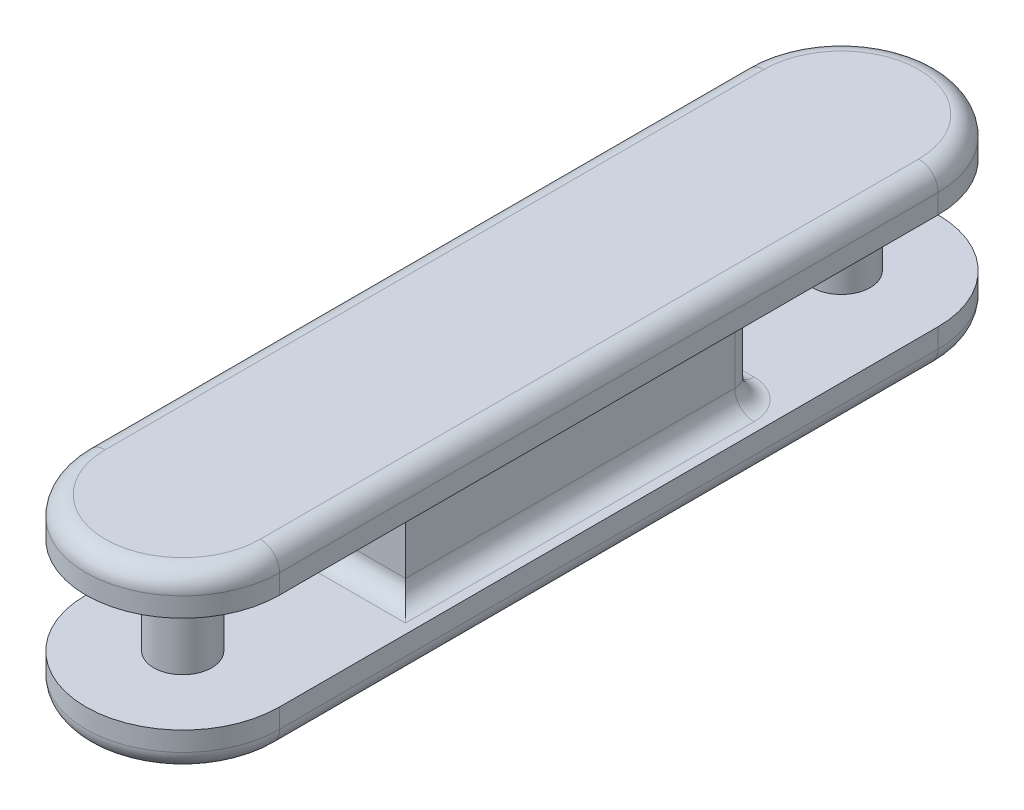
ISO-10303-21;
HEADER;
FILE_DESCRIPTION(('STEP AP214'),'2;1');
FILE_NAME('part.step','',(''),(''),'','','');
FILE_SCHEMA(('AUTOMOTIVE_DESIGN { 1 0 10303 214 1 1 1 1 }'));
ENDSEC;
DATA;
#1=APPLICATION_CONTEXT('core data for automotive mechanical design processes');
#2=APPLICATION_PROTOCOL_DEFINITION('international standard','automotive_design',2000,#1);
#3=PRODUCT_CONTEXT('',#1,'mechanical');
#4=PRODUCT('Part','Part','',(#3));
#5=PRODUCT_RELATED_PRODUCT_CATEGORY('part','',(#4));
#6=PRODUCT_DEFINITION_FORMATION('','',#4);
#7=PRODUCT_DEFINITION_CONTEXT('part definition',#1,'design');
#8=PRODUCT_DEFINITION('design','',#6,#7);
#9=PRODUCT_DEFINITION_SHAPE('','',#8);
#10=(LENGTH_UNIT() NAMED_UNIT(*) SI_UNIT(.MILLI.,.METRE.));
#11=(NAMED_UNIT(*) PLANE_ANGLE_UNIT() SI_UNIT($,.RADIAN.));
#12=(NAMED_UNIT(*) SI_UNIT($,.STERADIAN.) SOLID_ANGLE_UNIT());
#13=UNCERTAINTY_MEASURE_WITH_UNIT(LENGTH_MEASURE(1.E-05),#10,'distance_accuracy_value','');
#14=(GEOMETRIC_REPRESENTATION_CONTEXT(3) GLOBAL_UNCERTAINTY_ASSIGNED_CONTEXT((#13)) GLOBAL_UNIT_ASSIGNED_CONTEXT((#10,
#11,#12)) REPRESENTATION_CONTEXT('',''));
#15=CARTESIAN_POINT('',(0.,0.,0.));
#16=DIRECTION('',(0.,0.,1.));
#17=DIRECTION('',(1.,0.,0.));
#18=AXIS2_PLACEMENT_3D('',#15,#16,#17);
#19=CARTESIAN_POINT('',(0.,25.,170.));
#20=DIRECTION('',(0.,1.,0.));
#21=DIRECTION('',(0.,0.,1.));
#22=AXIS2_PLACEMENT_3D('',#19,#20,#21);
#23=PLANE('',#22);
#24=CARTESIAN_POINT('',(0.,25.,170.));
#25=DIRECTION('',(0.,1.,0.));
#26=DIRECTION('',(0.,0.,1.));
#27=AXIS2_PLACEMENT_3D('',#24,#25,#26);
#28=CIRCLE('',#27,50.);
#29=CARTESIAN_POINT('',(-50.,25.,170.));
#30=VERTEX_POINT('',#29);
#31=CARTESIAN_POINT('',(50.,25.,170.));
#32=VERTEX_POINT('',#31);
#33=EDGE_CURVE('E246',#30,#32,#28,.T.);
#34=ORIENTED_EDGE('',*,*,#33,.F.);
#35=DIRECTION('',(0.,0.,1.));
#36=VECTOR('',#35,1.);
#37=CARTESIAN_POINT('',(-50.,25.,-170.));
#38=LINE('',#37,#36);
#39=CARTESIAN_POINT('',(-50.,25.,-170.));
#40=VERTEX_POINT('',#39);
#41=EDGE_CURVE('E255',#40,#30,#38,.T.);
#42=ORIENTED_EDGE('',*,*,#41,.F.);
#43=CARTESIAN_POINT('',(0.,25.,-170.));
#44=DIRECTION('',(0.,1.,0.));
#45=DIRECTION('',(0.,0.,1.));
#46=AXIS2_PLACEMENT_3D('',#43,#44,#45);
#47=CIRCLE('',#46,50.);
#48=CARTESIAN_POINT('',(50.,25.,-170.));
#49=VERTEX_POINT('',#48);
#50=EDGE_CURVE('E252',#49,#40,#47,.T.);
#51=ORIENTED_EDGE('',*,*,#50,.F.);
#52=DIRECTION('',(0.,0.,-1.));
#53=VECTOR('',#52,1.);
#54=CARTESIAN_POINT('',(50.,25.,-170.));
#55=LINE('',#54,#53);
#56=EDGE_CURVE('E249',#32,#49,#55,.T.);
#57=ORIENTED_EDGE('',*,*,#56,.F.);
#58=EDGE_LOOP('',(#34,#42,#51,#57));
#59=FACE_BOUND('',#58,.T.);
#60=CARTESIAN_POINT('',(0.,25.,-170.));
#61=DIRECTION('',(0.,1.,0.));
#62=DIRECTION('',(0.,0.,1.));
#63=AXIS2_PLACEMENT_3D('',#60,#61,#62);
#64=CIRCLE('',#63,15.);
#65=CARTESIAN_POINT('',(0.,25.,-155.));
#66=VERTEX_POINT('',#65);
#67=EDGE_CURVE('E242',#66,#66,#64,.T.);
#68=ORIENTED_EDGE('',*,*,#67,.T.);
#69=EDGE_LOOP('',(#68));
#70=FACE_BOUND('',#69,.T.);
#71=CARTESIAN_POINT('',(0.,25.,170.));
#72=DIRECTION('',(0.,1.,0.));
#73=DIRECTION('',(0.,0.,1.));
#74=AXIS2_PLACEMENT_3D('',#71,#72,#73);
#75=CIRCLE('',#74,15.);
#76=CARTESIAN_POINT('',(0.,25.,185.));
#77=VERTEX_POINT('',#76);
#78=EDGE_CURVE('E231',#77,#77,#75,.T.);
#79=ORIENTED_EDGE('',*,*,#78,.T.);
#80=EDGE_LOOP('',(#79));
#81=FACE_BOUND('',#80,.T.);
#82=CARTESIAN_POINT('',(-25.,25.,80.));
#83=DIRECTION('',(0.,1.,0.));
#84=DIRECTION('',(0.,0.,1.));
#85=AXIS2_PLACEMENT_3D('',#82,#83,#84);
#86=CIRCLE('',#85,20.);
#87=CARTESIAN_POINT('',(-25.,25.,100.));
#88=VERTEX_POINT('',#87);
#89=CARTESIAN_POINT('',(-45.,25.,80.));
#90=VERTEX_POINT('',#89);
#91=EDGE_CURVE('E366',#88,#90,#86,.F.);
#92=ORIENTED_EDGE('',*,*,#91,.F.);
#93=DIRECTION('',(1.,0.,0.));
#94=VECTOR('',#93,1.);
#95=CARTESIAN_POINT('',(0.,25.,100.));
#96=LINE('',#95,#94);
#97=CARTESIAN_POINT('',(45.,25.,100.));
#98=VERTEX_POINT('',#97);
#99=EDGE_CURVE('E363',#88,#98,#96,.T.);
#100=ORIENTED_EDGE('',*,*,#99,.T.);
#101=DIRECTION('',(0.,0.,-1.));
#102=VECTOR('',#101,1.);
#103=CARTESIAN_POINT('',(45.,25.,170.));
#104=LINE('',#103,#102);
#105=CARTESIAN_POINT('',(45.,25.,-80.));
#106=VERTEX_POINT('',#105);
#107=EDGE_CURVE('E361',#98,#106,#104,.T.);
#108=ORIENTED_EDGE('',*,*,#107,.T.);
#109=CARTESIAN_POINT('',(25.,25.,-80.));
#110=DIRECTION('',(0.,1.,0.));
#111=DIRECTION('',(0.,0.,1.));
#112=AXIS2_PLACEMENT_3D('',#109,#110,#111);
#113=CIRCLE('',#112,20.);
#114=CARTESIAN_POINT('',(25.,25.,-100.));
#115=VERTEX_POINT('',#114);
#116=EDGE_CURVE('E358',#115,#106,#113,.F.);
#117=ORIENTED_EDGE('',*,*,#116,.F.);
#118=DIRECTION('',(-1.,0.,0.));
#119=VECTOR('',#118,1.);
#120=CARTESIAN_POINT('',(0.,25.,-100.));
#121=LINE('',#120,#119);
#122=CARTESIAN_POINT('',(-25.,25.,-100.));
#123=VERTEX_POINT('',#122);
#124=EDGE_CURVE('E354',#115,#123,#121,.T.);
#125=ORIENTED_EDGE('',*,*,#124,.T.);
#126=CARTESIAN_POINT('',(-25.,25.,-80.));
#127=DIRECTION('',(0.,1.,0.));
#128=DIRECTION('',(0.,0.,1.));
#129=AXIS2_PLACEMENT_3D('',#126,#127,#128);
#130=CIRCLE('',#129,20.);
#131=CARTESIAN_POINT('',(-45.,25.,-80.));
#132=VERTEX_POINT('',#131);
#133=EDGE_CURVE('E351',#132,#123,#130,.F.);
#134=ORIENTED_EDGE('',*,*,#133,.F.);
#135=DIRECTION('',(0.,0.,1.));
#136=VECTOR('',#135,1.);
#137=CARTESIAN_POINT('',(-45.,25.,170.));
#138=LINE('',#137,#136);
#139=EDGE_CURVE('E356',#132,#90,#138,.T.);
#140=ORIENTED_EDGE('',*,*,#139,.T.);
#141=EDGE_LOOP('',(#92,#100,#108,#117,#125,#134,#140));
#142=FACE_BOUND('',#141,.T.);
#143=ADVANCED_FACE('F33',(#59,#70,#81,#142),#23,.F.);
#144=CARTESIAN_POINT('',(0.,45.,170.));
#145=DIRECTION('',(0.,-1.,0.));
#146=DIRECTION('',(0.,0.,-1.));
#147=AXIS2_PLACEMENT_3D('',#144,#145,#146);
#148=CYLINDRICAL_SURFACE('',#147,50.);
#149=DIRECTION('',(0.,-1.,0.));
#150=VECTOR('',#149,1.);
#151=CARTESIAN_POINT('',(50.,45.,170.));
#152=LINE('',#151,#150);
#153=CARTESIAN_POINT('',(50.,35.,170.));
#154=VERTEX_POINT('',#153);
#155=EDGE_CURVE('E264',#154,#32,#152,.T.);
#156=ORIENTED_EDGE('',*,*,#155,.F.);
#157=CARTESIAN_POINT('',(0.,35.,170.));
#158=DIRECTION('',(0.,1.,0.));
#159=DIRECTION('',(0.,0.,1.));
#160=AXIS2_PLACEMENT_3D('',#157,#158,#159);
#161=CIRCLE('',#160,50.);
#162=CARTESIAN_POINT('',(-50.,35.,170.));
#163=VERTEX_POINT('',#162);
#164=EDGE_CURVE('E304',#154,#163,#161,.F.);
#165=ORIENTED_EDGE('',*,*,#164,.T.);
#166=DIRECTION('',(0.,-1.,0.));
#167=VECTOR('',#166,1.);
#168=CARTESIAN_POINT('',(-50.,45.,170.));
#169=LINE('',#168,#167);
#170=EDGE_CURVE('E258',#163,#30,#169,.T.);
#171=ORIENTED_EDGE('',*,*,#170,.T.);
#172=ORIENTED_EDGE('',*,*,#33,.T.);
#173=EDGE_LOOP('',(#156,#165,#171,#172));
#174=FACE_BOUND('',#173,.T.);
#175=ADVANCED_FACE('F493',(#174),#148,.T.);
#176=CARTESIAN_POINT('',(50.,45.,-170.));
#177=DIRECTION('',(-1.,0.,0.));
#178=DIRECTION('',(0.,0.,1.));
#179=AXIS2_PLACEMENT_3D('',#176,#177,#178);
#180=PLANE('',#179);
#181=DIRECTION('',(0.,-1.,0.));
#182=VECTOR('',#181,1.);
#183=CARTESIAN_POINT('',(50.,45.,-170.));
#184=LINE('',#183,#182);
#185=CARTESIAN_POINT('',(50.,35.,-170.));
#186=VERTEX_POINT('',#185);
#187=EDGE_CURVE('E262',#186,#49,#184,.T.);
#188=ORIENTED_EDGE('',*,*,#187,.F.);
#189=DIRECTION('',(0.,0.,-1.));
#190=VECTOR('',#189,1.);
#191=CARTESIAN_POINT('',(50.,35.,170.));
#192=LINE('',#191,#190);
#193=EDGE_CURVE('E302',#186,#154,#192,.F.);
#194=ORIENTED_EDGE('',*,*,#193,.T.);
#195=ORIENTED_EDGE('',*,*,#155,.T.);
#196=ORIENTED_EDGE('',*,*,#56,.T.);
#197=EDGE_LOOP('',(#188,#194,#195,#196));
#198=FACE_BOUND('',#197,.T.);
#199=ADVANCED_FACE('F499',(#198),#180,.F.);
#200=CARTESIAN_POINT('',(0.,45.,-170.));
#201=DIRECTION('',(0.,-1.,0.));
#202=DIRECTION('',(0.,0.,-1.));
#203=AXIS2_PLACEMENT_3D('',#200,#201,#202);
#204=CYLINDRICAL_SURFACE('',#203,50.);
#205=DIRECTION('',(0.,-1.,0.));
#206=VECTOR('',#205,1.);
#207=CARTESIAN_POINT('',(-50.,45.,-170.));
#208=LINE('',#207,#206);
#209=CARTESIAN_POINT('',(-50.,35.,-170.));
#210=VERTEX_POINT('',#209);
#211=EDGE_CURVE('E260',#210,#40,#208,.T.);
#212=ORIENTED_EDGE('',*,*,#211,.F.);
#213=CARTESIAN_POINT('',(0.,35.,-170.));
#214=DIRECTION('',(0.,1.,0.));
#215=DIRECTION('',(0.,0.,1.));
#216=AXIS2_PLACEMENT_3D('',#213,#214,#215);
#217=CIRCLE('',#216,50.);
#218=EDGE_CURVE('E300',#210,#186,#217,.F.);
#219=ORIENTED_EDGE('',*,*,#218,.T.);
#220=ORIENTED_EDGE('',*,*,#187,.T.);
#221=ORIENTED_EDGE('',*,*,#50,.T.);
#222=EDGE_LOOP('',(#212,#219,#220,#221));
#223=FACE_BOUND('',#222,.T.);
#224=ADVANCED_FACE('F511',(#223),#204,.T.);
#225=CARTESIAN_POINT('',(-50.,45.,-170.));
#226=DIRECTION('',(1.,0.,0.));
#227=DIRECTION('',(0.,0.,-1.));
#228=AXIS2_PLACEMENT_3D('',#225,#226,#227);
#229=PLANE('',#228);
#230=ORIENTED_EDGE('',*,*,#170,.F.);
#231=DIRECTION('',(0.,0.,1.));
#232=VECTOR('',#231,1.);
#233=CARTESIAN_POINT('',(-50.,35.,-170.));
#234=LINE('',#233,#232);
#235=EDGE_CURVE('E297',#163,#210,#234,.F.);
#236=ORIENTED_EDGE('',*,*,#235,.T.);
#237=ORIENTED_EDGE('',*,*,#211,.T.);
#238=ORIENTED_EDGE('',*,*,#41,.T.);
#239=EDGE_LOOP('',(#230,#236,#237,#238));
#240=FACE_BOUND('',#239,.T.);
#241=ADVANCED_FACE('F508',(#240),#229,.F.);
#242=CARTESIAN_POINT('',(0.,45.,170.));
#243=DIRECTION('',(0.,1.,0.));
#244=DIRECTION('',(0.,0.,1.));
#245=AXIS2_PLACEMENT_3D('',#242,#243,#244);
#246=PLANE('',#245);
#247=CARTESIAN_POINT('',(0.,45.,-170.));
#248=DIRECTION('',(0.,1.,0.));
#249=DIRECTION('',(0.,0.,1.));
#250=AXIS2_PLACEMENT_3D('',#247,#248,#249);
#251=CIRCLE('',#250,40.);
#252=CARTESIAN_POINT('',(40.,45.,-170.));
#253=VERTEX_POINT('',#252);
#254=CARTESIAN_POINT('',(-40.,45.,-170.));
#255=VERTEX_POINT('',#254);
#256=EDGE_CURVE('E292',#253,#255,#251,.T.);
#257=ORIENTED_EDGE('',*,*,#256,.T.);
#258=DIRECTION('',(0.,0.,1.));
#259=VECTOR('',#258,1.);
#260=CARTESIAN_POINT('',(-40.,45.,170.));
#261=LINE('',#260,#259);
#262=CARTESIAN_POINT('',(-40.,45.,170.));
#263=VERTEX_POINT('',#262);
#264=EDGE_CURVE('E294',#255,#263,#261,.T.);
#265=ORIENTED_EDGE('',*,*,#264,.T.);
#266=CARTESIAN_POINT('',(0.,45.,170.));
#267=DIRECTION('',(0.,1.,0.));
#268=DIRECTION('',(0.,0.,1.));
#269=AXIS2_PLACEMENT_3D('',#266,#267,#268);
#270=CIRCLE('',#269,40.);
#271=CARTESIAN_POINT('',(40.,45.,170.));
#272=VERTEX_POINT('',#271);
#273=EDGE_CURVE('E288',#263,#272,#270,.T.);
#274=ORIENTED_EDGE('',*,*,#273,.T.);
#275=DIRECTION('',(0.,0.,-1.));
#276=VECTOR('',#275,1.);
#277=CARTESIAN_POINT('',(40.,45.,-170.));
#278=LINE('',#277,#276);
#279=EDGE_CURVE('E290',#272,#253,#278,.T.);
#280=ORIENTED_EDGE('',*,*,#279,.T.);
#281=EDGE_LOOP('',(#257,#265,#274,#280));
#282=FACE_BOUND('',#281,.T.);
#283=ADVANCED_FACE('F506',(#282),#246,.T.);
#284=CARTESIAN_POINT('',(0.,-238.13207915828,-170.));
#285=DIRECTION('',(0.,1.,0.));
#286=DIRECTION('',(0.,0.,1.));
#287=AXIS2_PLACEMENT_3D('',#284,#285,#286);
#288=CYLINDRICAL_SURFACE('',#287,15.);
#289=CARTESIAN_POINT('',(0.,-25.,-170.));
#290=DIRECTION('',(0.,1.,0.));
#291=DIRECTION('',(0.,0.,1.));
#292=AXIS2_PLACEMENT_3D('',#289,#290,#291);
#293=CIRCLE('',#292,15.);
#294=CARTESIAN_POINT('',(0.,-25.,-155.));
#295=VERTEX_POINT('',#294);
#296=EDGE_CURVE('E266',#295,#295,#293,.F.);
#297=ORIENTED_EDGE('',*,*,#296,.F.);
#298=EDGE_LOOP('',(#297));
#299=FACE_BOUND('',#298,.T.);
#300=ORIENTED_EDGE('',*,*,#67,.F.);
#301=EDGE_LOOP('',(#300));
#302=FACE_BOUND('',#301,.T.);
#303=ADVANCED_FACE('F621',(#299,#302),#288,.T.);
#304=CARTESIAN_POINT('',(0.,-45.,-170.));
#305=DIRECTION('',(0.,1.,0.));
#306=DIRECTION('',(0.,0.,1.));
#307=AXIS2_PLACEMENT_3D('',#304,#305,#306);
#308=CYLINDRICAL_SURFACE('',#307,50.);
#309=DIRECTION('',(0.,1.,0.));
#310=VECTOR('',#309,1.);
#311=CARTESIAN_POINT('',(50.,-45.,-170.));
#312=LINE('',#311,#310);
#313=CARTESIAN_POINT('',(50.,-35.,-170.));
#314=VERTEX_POINT('',#313);
#315=CARTESIAN_POINT('',(50.,-25.,-170.));
#316=VERTEX_POINT('',#315);
#317=EDGE_CURVE('E240',#314,#316,#312,.T.);
#318=ORIENTED_EDGE('',*,*,#317,.F.);
#319=CARTESIAN_POINT('',(0.,-35.,-170.));
#320=DIRECTION('',(0.,1.,0.));
#321=DIRECTION('',(0.,0.,1.));
#322=AXIS2_PLACEMENT_3D('',#319,#320,#321);
#323=CIRCLE('',#322,50.);
#324=CARTESIAN_POINT('',(-50.,-35.,-170.));
#325=VERTEX_POINT('',#324);
#326=EDGE_CURVE('E213',#314,#325,#323,.T.);
#327=ORIENTED_EDGE('',*,*,#326,.T.);
#328=DIRECTION('',(0.,1.,0.));
#329=VECTOR('',#328,1.);
#330=CARTESIAN_POINT('',(-50.,-45.,-170.));
#331=LINE('',#330,#329);
#332=CARTESIAN_POINT('',(-50.,-25.,-170.));
#333=VERTEX_POINT('',#332);
#334=EDGE_CURVE('E205',#325,#333,#331,.T.);
#335=ORIENTED_EDGE('',*,*,#334,.T.);
#336=CARTESIAN_POINT('',(0.,-25.,-170.));
#337=DIRECTION('',(0.,1.,0.));
#338=DIRECTION('',(0.,0.,1.));
#339=AXIS2_PLACEMENT_3D('',#336,#337,#338);
#340=CIRCLE('',#339,50.);
#341=EDGE_CURVE('E210',#316,#333,#340,.T.);
#342=ORIENTED_EDGE('',*,*,#341,.F.);
#343=EDGE_LOOP('',(#318,#327,#335,#342));
#344=FACE_BOUND('',#343,.T.);
#345=ADVANCED_FACE('F208',(#344),#308,.T.);
#346=CARTESIAN_POINT('',(50.,-45.,170.));
#347=DIRECTION('',(1.,0.,0.));
#348=DIRECTION('',(0.,0.,-1.));
#349=AXIS2_PLACEMENT_3D('',#346,#347,#348);
#350=PLANE('',#349);
#351=DIRECTION('',(0.,1.,0.));
#352=VECTOR('',#351,1.);
#353=CARTESIAN_POINT('',(50.,-45.,170.));
#354=LINE('',#353,#352);
#355=CARTESIAN_POINT('',(50.,-35.,170.));
#356=VERTEX_POINT('',#355);
#357=CARTESIAN_POINT('',(50.,-25.,170.));
#358=VERTEX_POINT('',#357);
#359=EDGE_CURVE('E243',#356,#358,#354,.T.);
#360=ORIENTED_EDGE('',*,*,#359,.F.);
#361=DIRECTION('',(0.,0.,-1.));
#362=VECTOR('',#361,1.);
#363=CARTESIAN_POINT('',(50.,-35.,-170.));
#364=LINE('',#363,#362);
#365=EDGE_CURVE('E285',#356,#314,#364,.T.);
#366=ORIENTED_EDGE('',*,*,#365,.T.);
#367=ORIENTED_EDGE('',*,*,#317,.T.);
#368=DIRECTION('',(0.,0.,-1.));
#369=VECTOR('',#368,1.);
#370=CARTESIAN_POINT('',(50.,-25.,170.));
#371=LINE('',#370,#369);
#372=EDGE_CURVE('E218',#358,#316,#371,.T.);
#373=ORIENTED_EDGE('',*,*,#372,.F.);
#374=EDGE_LOOP('',(#360,#366,#367,#373));
#375=FACE_BOUND('',#374,.T.);
#376=ADVANCED_FACE('F636',(#375),#350,.T.);
#377=CARTESIAN_POINT('',(0.,-45.,170.));
#378=DIRECTION('',(0.,1.,0.));
#379=DIRECTION('',(0.,0.,1.));
#380=AXIS2_PLACEMENT_3D('',#377,#378,#379);
#381=CYLINDRICAL_SURFACE('',#380,50.);
#382=DIRECTION('',(0.,1.,0.));
#383=VECTOR('',#382,1.);
#384=CARTESIAN_POINT('',(-50.,-45.,170.));
#385=LINE('',#384,#383);
#386=CARTESIAN_POINT('',(-50.,-35.,170.));
#387=VERTEX_POINT('',#386);
#388=CARTESIAN_POINT('',(-50.,-25.,170.));
#389=VERTEX_POINT('',#388);
#390=EDGE_CURVE('E217',#387,#389,#385,.T.);
#391=ORIENTED_EDGE('',*,*,#390,.F.);
#392=CARTESIAN_POINT('',(0.,-35.,170.));
#393=DIRECTION('',(0.,1.,0.));
#394=DIRECTION('',(0.,0.,1.));
#395=AXIS2_PLACEMENT_3D('',#392,#393,#394);
#396=CIRCLE('',#395,50.);
#397=EDGE_CURVE('E283',#387,#356,#396,.T.);
#398=ORIENTED_EDGE('',*,*,#397,.T.);
#399=ORIENTED_EDGE('',*,*,#359,.T.);
#400=CARTESIAN_POINT('',(0.,-25.,170.));
#401=DIRECTION('',(0.,1.,0.));
#402=DIRECTION('',(0.,0.,1.));
#403=AXIS2_PLACEMENT_3D('',#400,#401,#402);
#404=CIRCLE('',#403,50.);
#405=EDGE_CURVE('E227',#389,#358,#404,.T.);
#406=ORIENTED_EDGE('',*,*,#405,.F.);
#407=EDGE_LOOP('',(#391,#398,#399,#406));
#408=FACE_BOUND('',#407,.T.);
#409=ADVANCED_FACE('F639',(#408),#381,.T.);
#410=CARTESIAN_POINT('',(-50.,-45.,-170.));
#411=DIRECTION('',(-1.,0.,0.));
#412=DIRECTION('',(0.,0.,1.));
#413=AXIS2_PLACEMENT_3D('',#410,#411,#412);
#414=PLANE('',#413);
#415=ORIENTED_EDGE('',*,*,#334,.F.);
#416=DIRECTION('',(0.,0.,1.));
#417=VECTOR('',#416,1.);
#418=CARTESIAN_POINT('',(-50.,-35.,170.));
#419=LINE('',#418,#417);
#420=EDGE_CURVE('E272',#325,#387,#419,.T.);
#421=ORIENTED_EDGE('',*,*,#420,.T.);
#422=ORIENTED_EDGE('',*,*,#390,.T.);
#423=DIRECTION('',(0.,0.,1.));
#424=VECTOR('',#423,1.);
#425=CARTESIAN_POINT('',(-50.,-25.,-170.));
#426=LINE('',#425,#424);
#427=EDGE_CURVE('E221',#333,#389,#426,.T.);
#428=ORIENTED_EDGE('',*,*,#427,.F.);
#429=EDGE_LOOP('',(#415,#421,#422,#428));
#430=FACE_BOUND('',#429,.T.);
#431=ADVANCED_FACE('F222',(#430),#414,.T.);
#432=CARTESIAN_POINT('',(0.,-25.,-170.));
#433=DIRECTION('',(0.,1.,0.));
#434=DIRECTION('',(0.,0.,1.));
#435=AXIS2_PLACEMENT_3D('',#432,#433,#434);
#436=PLANE('',#435);
#437=DIRECTION('',(0.,0.,-1.));
#438=VECTOR('',#437,1.);
#439=CARTESIAN_POINT('',(45.,-25.,90.));
#440=LINE('',#439,#438);
#441=CARTESIAN_POINT('',(45.,-25.,-80.));
#442=VERTEX_POINT('',#441);
#443=CARTESIAN_POINT('',(45.,-25.,100.));
#444=VERTEX_POINT('',#443);
#445=EDGE_CURVE('E343',#442,#444,#440,.F.);
#446=ORIENTED_EDGE('',*,*,#445,.T.);
#447=DIRECTION('',(1.,0.,0.));
#448=VECTOR('',#447,1.);
#449=CARTESIAN_POINT('',(-35.,-25.,100.));
#450=LINE('',#449,#448);
#451=CARTESIAN_POINT('',(-25.,-25.,100.));
#452=VERTEX_POINT('',#451);
#453=EDGE_CURVE('E348',#444,#452,#450,.F.);
#454=ORIENTED_EDGE('',*,*,#453,.T.);
#455=CARTESIAN_POINT('',(-25.,-25.,80.));
#456=DIRECTION('',(0.,1.,0.));
#457=DIRECTION('',(0.,0.,1.));
#458=AXIS2_PLACEMENT_3D('',#455,#456,#457);
#459=CIRCLE('',#458,20.);
#460=CARTESIAN_POINT('',(-45.,-25.,80.));
#461=VERTEX_POINT('',#460);
#462=EDGE_CURVE('E345',#461,#452,#459,.T.);
#463=ORIENTED_EDGE('',*,*,#462,.F.);
#464=DIRECTION('',(0.,0.,1.));
#465=VECTOR('',#464,1.);
#466=CARTESIAN_POINT('',(-45.,-25.,-90.));
#467=LINE('',#466,#465);
#468=CARTESIAN_POINT('',(-45.,-25.,-80.));
#469=VERTEX_POINT('',#468);
#470=EDGE_CURVE('E341',#461,#469,#467,.F.);
#471=ORIENTED_EDGE('',*,*,#470,.T.);
#472=CARTESIAN_POINT('',(-25.,-25.,-80.));
#473=DIRECTION('',(0.,1.,0.));
#474=DIRECTION('',(0.,0.,1.));
#475=AXIS2_PLACEMENT_3D('',#472,#473,#474);
#476=CIRCLE('',#475,20.);
#477=CARTESIAN_POINT('',(-25.,-25.,-100.));
#478=VERTEX_POINT('',#477);
#479=EDGE_CURVE('E338',#478,#469,#476,.T.);
#480=ORIENTED_EDGE('',*,*,#479,.F.);
#481=DIRECTION('',(-1.,0.,0.));
#482=VECTOR('',#481,1.);
#483=CARTESIAN_POINT('',(35.,-25.,-100.));
#484=LINE('',#483,#482);
#485=CARTESIAN_POINT('',(25.,-25.,-100.));
#486=VERTEX_POINT('',#485);
#487=EDGE_CURVE('E336',#478,#486,#484,.F.);
#488=ORIENTED_EDGE('',*,*,#487,.T.);
#489=CARTESIAN_POINT('',(25.,-25.,-80.));
#490=DIRECTION('',(0.,1.,0.));
#491=DIRECTION('',(0.,0.,1.));
#492=AXIS2_PLACEMENT_3D('',#489,#490,#491);
#493=CIRCLE('',#492,20.);
#494=EDGE_CURVE('E333',#442,#486,#493,.T.);
#495=ORIENTED_EDGE('',*,*,#494,.F.);
#496=EDGE_LOOP('',(#446,#454,#463,#471,#480,#488,#495));
#497=FACE_BOUND('',#496,.T.);
#498=CARTESIAN_POINT('',(0.,-25.,170.));
#499=DIRECTION('',(0.,1.,0.));
#500=DIRECTION('',(0.,0.,1.));
#501=AXIS2_PLACEMENT_3D('',#498,#499,#500);
#502=CIRCLE('',#501,15.);
#503=CARTESIAN_POINT('',(0.,-25.,185.));
#504=VERTEX_POINT('',#503);
#505=EDGE_CURVE('E271',#504,#504,#502,.T.);
#506=ORIENTED_EDGE('',*,*,#505,.F.);
#507=EDGE_LOOP('',(#506));
#508=FACE_BOUND('',#507,.T.);
#509=ORIENTED_EDGE('',*,*,#296,.T.);
#510=EDGE_LOOP('',(#509));
#511=FACE_BOUND('',#510,.T.);
#512=ORIENTED_EDGE('',*,*,#341,.T.);
#513=ORIENTED_EDGE('',*,*,#427,.T.);
#514=ORIENTED_EDGE('',*,*,#405,.T.);
#515=ORIENTED_EDGE('',*,*,#372,.T.);
#516=EDGE_LOOP('',(#512,#513,#514,#515));
#517=FACE_BOUND('',#516,.T.);
#518=ADVANCED_FACE('F229',(#497,#508,#511,#517),#436,.T.);
#519=CARTESIAN_POINT('',(0.,-45.,-170.));
#520=DIRECTION('',(0.,1.,0.));
#521=DIRECTION('',(0.,0.,1.));
#522=AXIS2_PLACEMENT_3D('',#519,#520,#521);
#523=PLANE('',#522);
#524=CARTESIAN_POINT('',(0.,-45.,170.));
#525=DIRECTION('',(0.,1.,0.));
#526=DIRECTION('',(0.,0.,1.));
#527=AXIS2_PLACEMENT_3D('',#524,#525,#526);
#528=CIRCLE('',#527,40.);
#529=CARTESIAN_POINT('',(40.,-45.,170.));
#530=VERTEX_POINT('',#529);
#531=CARTESIAN_POINT('',(-40.,-45.,170.));
#532=VERTEX_POINT('',#531);
#533=EDGE_CURVE('E278',#530,#532,#528,.F.);
#534=ORIENTED_EDGE('',*,*,#533,.T.);
#535=DIRECTION('',(0.,0.,1.));
#536=VECTOR('',#535,1.);
#537=CARTESIAN_POINT('',(-40.,-45.,-170.));
#538=LINE('',#537,#536);
#539=CARTESIAN_POINT('',(-40.,-45.,-170.));
#540=VERTEX_POINT('',#539);
#541=EDGE_CURVE('E280',#532,#540,#538,.F.);
#542=ORIENTED_EDGE('',*,*,#541,.T.);
#543=CARTESIAN_POINT('',(0.,-45.,-170.));
#544=DIRECTION('',(0.,1.,0.));
#545=DIRECTION('',(0.,0.,1.));
#546=AXIS2_PLACEMENT_3D('',#543,#544,#545);
#547=CIRCLE('',#546,40.);
#548=CARTESIAN_POINT('',(40.,-45.,-170.));
#549=VERTEX_POINT('',#548);
#550=EDGE_CURVE('E274',#540,#549,#547,.F.);
#551=ORIENTED_EDGE('',*,*,#550,.T.);
#552=DIRECTION('',(0.,0.,-1.));
#553=VECTOR('',#552,1.);
#554=CARTESIAN_POINT('',(40.,-45.,170.));
#555=LINE('',#554,#553);
#556=EDGE_CURVE('E276',#549,#530,#555,.F.);
#557=ORIENTED_EDGE('',*,*,#556,.T.);
#558=EDGE_LOOP('',(#534,#542,#551,#557));
#559=FACE_BOUND('',#558,.T.);
#560=ADVANCED_FACE('F616',(#559),#523,.F.);
#561=CARTESIAN_POINT('',(0.,-238.13207915828,170.));
#562=DIRECTION('',(0.,1.,0.));
#563=DIRECTION('',(0.,0.,1.));
#564=AXIS2_PLACEMENT_3D('',#561,#562,#563);
#565=CYLINDRICAL_SURFACE('',#564,15.);
#566=ORIENTED_EDGE('',*,*,#505,.T.);
#567=EDGE_LOOP('',(#566));
#568=FACE_BOUND('',#567,.T.);
#569=ORIENTED_EDGE('',*,*,#78,.F.);
#570=EDGE_LOOP('',(#569));
#571=FACE_BOUND('',#570,.T.);
#572=ADVANCED_FACE('F611',(#568,#571),#565,.T.);
#573=CARTESIAN_POINT('',(35.,-238.13207915828,90.));
#574=DIRECTION('',(1.,0.,0.));
#575=DIRECTION('',(0.,0.,-1.));
#576=AXIS2_PLACEMENT_3D('',#573,#574,#575);
#577=PLANE('',#576);
#578=DIRECTION('',(0.,1.,0.));
#579=VECTOR('',#578,1.);
#580=CARTESIAN_POINT('',(35.,-238.13207915828,90.));
#581=LINE('',#580,#579);
#582=CARTESIAN_POINT('',(35.,-15.,90.));
#583=VERTEX_POINT('',#582);
#584=CARTESIAN_POINT('',(35.,15.,90.));
#585=VERTEX_POINT('',#584);
#586=EDGE_CURVE('E234',#583,#585,#581,.T.);
#587=ORIENTED_EDGE('',*,*,#586,.F.);
#588=DIRECTION('',(0.,0.,-1.));
#589=VECTOR('',#588,1.);
#590=CARTESIAN_POINT('',(35.,-15.,-90.));
#591=LINE('',#590,#589);
#592=CARTESIAN_POINT('',(35.,-15.,-80.));
#593=VERTEX_POINT('',#592);
#594=EDGE_CURVE('E373',#583,#593,#591,.T.);
#595=ORIENTED_EDGE('',*,*,#594,.T.);
#596=DIRECTION('',(0.,1.,0.));
#597=VECTOR('',#596,1.);
#598=CARTESIAN_POINT('',(35.,-238.13207915828,-80.));
#599=LINE('',#598,#597);
#600=CARTESIAN_POINT('',(35.,15.,-80.));
#601=VERTEX_POINT('',#600);
#602=EDGE_CURVE('E369',#593,#601,#599,.T.);
#603=ORIENTED_EDGE('',*,*,#602,.T.);
#604=DIRECTION('',(0.,0.,-1.));
#605=VECTOR('',#604,1.);
#606=CARTESIAN_POINT('',(35.,15.,90.));
#607=LINE('',#606,#605);
#608=EDGE_CURVE('E371',#601,#585,#607,.F.);
#609=ORIENTED_EDGE('',*,*,#608,.T.);
#610=EDGE_LOOP('',(#587,#595,#603,#609));
#611=FACE_BOUND('',#610,.T.);
#612=ADVANCED_FACE('F603',(#611),#577,.T.);
#613=CARTESIAN_POINT('',(-35.,-238.13207915828,90.));
#614=DIRECTION('',(0.,0.,1.));
#615=DIRECTION('',(1.,0.,0.));
#616=AXIS2_PLACEMENT_3D('',#613,#614,#615);
#617=PLANE('',#616);
#618=DIRECTION('',(0.,1.,0.));
#619=VECTOR('',#618,1.);
#620=CARTESIAN_POINT('',(-25.,-238.13207915828,90.));
#621=LINE('',#620,#619);
#622=CARTESIAN_POINT('',(-25.,15.,90.));
#623=VERTEX_POINT('',#622);
#624=CARTESIAN_POINT('',(-25.,-15.,90.));
#625=VERTEX_POINT('',#624);
#626=EDGE_CURVE('E306',#623,#625,#621,.F.);
#627=ORIENTED_EDGE('',*,*,#626,.T.);
#628=DIRECTION('',(1.,0.,0.));
#629=VECTOR('',#628,1.);
#630=CARTESIAN_POINT('',(35.,-15.,90.));
#631=LINE('',#630,#629);
#632=EDGE_CURVE('E330',#625,#583,#631,.T.);
#633=ORIENTED_EDGE('',*,*,#632,.T.);
#634=ORIENTED_EDGE('',*,*,#586,.T.);
#635=DIRECTION('',(1.,0.,0.));
#636=VECTOR('',#635,1.);
#637=CARTESIAN_POINT('',(-35.,15.,90.));
#638=LINE('',#637,#636);
#639=EDGE_CURVE('E328',#585,#623,#638,.F.);
#640=ORIENTED_EDGE('',*,*,#639,.T.);
#641=EDGE_LOOP('',(#627,#633,#634,#640));
#642=FACE_BOUND('',#641,.T.);
#643=ADVANCED_FACE('F488',(#642),#617,.T.);
#644=CARTESIAN_POINT('',(-35.,-238.13207915828,90.));
#645=DIRECTION('',(-1.,0.,0.));
#646=DIRECTION('',(0.,0.,1.));
#647=AXIS2_PLACEMENT_3D('',#644,#645,#646);
#648=PLANE('',#647);
#649=DIRECTION('',(0.,0.,1.));
#650=VECTOR('',#649,1.);
#651=CARTESIAN_POINT('',(-35.,-15.,90.));
#652=LINE('',#651,#650);
#653=CARTESIAN_POINT('',(-35.,-15.,-80.));
#654=VERTEX_POINT('',#653);
#655=CARTESIAN_POINT('',(-35.,-15.,80.));
#656=VERTEX_POINT('',#655);
#657=EDGE_CURVE('E379',#654,#656,#652,.T.);
#658=ORIENTED_EDGE('',*,*,#657,.T.);
#659=DIRECTION('',(0.,1.,0.));
#660=VECTOR('',#659,1.);
#661=CARTESIAN_POINT('',(-35.,-238.13207915828,80.));
#662=LINE('',#661,#660);
#663=CARTESIAN_POINT('',(-35.,15.,80.));
#664=VERTEX_POINT('',#663);
#665=EDGE_CURVE('E381',#656,#664,#662,.T.);
#666=ORIENTED_EDGE('',*,*,#665,.T.);
#667=DIRECTION('',(0.,0.,1.));
#668=VECTOR('',#667,1.);
#669=CARTESIAN_POINT('',(-35.,15.,90.));
#670=LINE('',#669,#668);
#671=CARTESIAN_POINT('',(-35.,15.,-80.));
#672=VERTEX_POINT('',#671);
#673=EDGE_CURVE('E377',#664,#672,#670,.F.);
#674=ORIENTED_EDGE('',*,*,#673,.T.);
#675=DIRECTION('',(0.,1.,0.));
#676=VECTOR('',#675,1.);
#677=CARTESIAN_POINT('',(-35.,-238.13207915828,-80.));
#678=LINE('',#677,#676);
#679=EDGE_CURVE('E375',#672,#654,#678,.F.);
#680=ORIENTED_EDGE('',*,*,#679,.T.);
#681=EDGE_LOOP('',(#658,#666,#674,#680));
#682=FACE_BOUND('',#681,.T.);
#683=ADVANCED_FACE('F479',(#682),#648,.T.);
#684=CARTESIAN_POINT('',(-35.,-238.13207915828,-90.));
#685=DIRECTION('',(0.,0.,-1.));
#686=DIRECTION('',(-1.,0.,0.));
#687=AXIS2_PLACEMENT_3D('',#684,#685,#686);
#688=PLANE('',#687);
#689=DIRECTION('',(-1.,0.,0.));
#690=VECTOR('',#689,1.);
#691=CARTESIAN_POINT('',(-35.,-15.,-90.));
#692=LINE('',#691,#690);
#693=CARTESIAN_POINT('',(25.,-15.,-90.));
#694=VERTEX_POINT('',#693);
#695=CARTESIAN_POINT('',(-25.,-15.,-90.));
#696=VERTEX_POINT('',#695);
#697=EDGE_CURVE('E42',#694,#696,#692,.T.);
#698=ORIENTED_EDGE('',*,*,#697,.T.);
#699=DIRECTION('',(0.,1.,0.));
#700=VECTOR('',#699,1.);
#701=CARTESIAN_POINT('',(-25.,-238.13207915828,-90.));
#702=LINE('',#701,#700);
#703=CARTESIAN_POINT('',(-25.,15.,-90.));
#704=VERTEX_POINT('',#703);
#705=EDGE_CURVE('E11',#696,#704,#702,.T.);
#706=ORIENTED_EDGE('',*,*,#705,.T.);
#707=DIRECTION('',(-1.,0.,0.));
#708=VECTOR('',#707,1.);
#709=CARTESIAN_POINT('',(-35.,15.,-90.));
#710=LINE('',#709,#708);
#711=CARTESIAN_POINT('',(25.,15.,-90.));
#712=VERTEX_POINT('',#711);
#713=EDGE_CURVE('E384',#704,#712,#710,.F.);
#714=ORIENTED_EDGE('',*,*,#713,.T.);
#715=DIRECTION('',(0.,1.,0.));
#716=VECTOR('',#715,1.);
#717=CARTESIAN_POINT('',(25.,-238.13207915828,-90.));
#718=LINE('',#717,#716);
#719=EDGE_CURVE('E53',#712,#694,#718,.F.);
#720=ORIENTED_EDGE('',*,*,#719,.T.);
#721=EDGE_LOOP('',(#698,#706,#714,#720));
#722=FACE_BOUND('',#721,.T.);
#723=ADVANCED_FACE('F476',(#722),#688,.T.);
#724=CARTESIAN_POINT('',(40.,-35.,170.));
#725=DIRECTION('',(0.,0.,1.));
#726=DIRECTION('',(1.,0.,0.));
#727=AXIS2_PLACEMENT_3D('',#724,#725,#726);
#728=CYLINDRICAL_SURFACE('',#727,10.);
#729=CARTESIAN_POINT('',(40.,-35.,170.));
#730=DIRECTION('',(0.,0.,1.));
#731=DIRECTION('',(1.,0.,0.));
#732=AXIS2_PLACEMENT_3D('',#729,#730,#731);
#733=CIRCLE('',#732,10.);
#734=EDGE_CURVE('E312',#530,#356,#733,.T.);
#735=ORIENTED_EDGE('',*,*,#734,.F.);
#736=ORIENTED_EDGE('',*,*,#556,.F.);
#737=CARTESIAN_POINT('',(40.,-35.,-170.));
#738=DIRECTION('',(0.,0.,-1.));
#739=DIRECTION('',(-1.,0.,0.));
#740=AXIS2_PLACEMENT_3D('',#737,#738,#739);
#741=CIRCLE('',#740,10.);
#742=EDGE_CURVE('E315',#314,#549,#741,.T.);
#743=ORIENTED_EDGE('',*,*,#742,.F.);
#744=ORIENTED_EDGE('',*,*,#365,.F.);
#745=EDGE_LOOP('',(#735,#736,#743,#744));
#746=FACE_BOUND('',#745,.T.);
#747=ADVANCED_FACE('F478',(#746),#728,.T.);
#748=CARTESIAN_POINT('',(0.,-35.,-170.));
#749=DIRECTION('',(0.,1.,0.));
#750=DIRECTION('',(0.,0.,1.));
#751=AXIS2_PLACEMENT_3D('',#748,#749,#750);
#752=TOROIDAL_SURFACE('',#751,40.,10.);
#753=ORIENTED_EDGE('',*,*,#742,.T.);
#754=ORIENTED_EDGE('',*,*,#550,.F.);
#755=CARTESIAN_POINT('',(-40.,-35.,-170.));
#756=DIRECTION('',(0.,0.,1.));
#757=DIRECTION('',(1.,0.,0.));
#758=AXIS2_PLACEMENT_3D('',#755,#756,#757);
#759=CIRCLE('',#758,10.);
#760=EDGE_CURVE('E309',#325,#540,#759,.T.);
#761=ORIENTED_EDGE('',*,*,#760,.F.);
#762=ORIENTED_EDGE('',*,*,#326,.F.);
#763=EDGE_LOOP('',(#753,#754,#761,#762));
#764=FACE_BOUND('',#763,.T.);
#765=ADVANCED_FACE('F485',(#764),#752,.T.);
#766=CARTESIAN_POINT('',(0.,-35.,170.));
#767=DIRECTION('',(0.,1.,0.));
#768=DIRECTION('',(0.,0.,1.));
#769=AXIS2_PLACEMENT_3D('',#766,#767,#768);
#770=TOROIDAL_SURFACE('',#769,40.,10.);
#771=ORIENTED_EDGE('',*,*,#734,.T.);
#772=ORIENTED_EDGE('',*,*,#397,.F.);
#773=CARTESIAN_POINT('',(-40.,-35.,170.));
#774=DIRECTION('',(0.,0.,-1.));
#775=DIRECTION('',(-1.,0.,0.));
#776=AXIS2_PLACEMENT_3D('',#773,#774,#775);
#777=CIRCLE('',#776,10.);
#778=EDGE_CURVE('E307',#532,#387,#777,.T.);
#779=ORIENTED_EDGE('',*,*,#778,.F.);
#780=ORIENTED_EDGE('',*,*,#533,.F.);
#781=EDGE_LOOP('',(#771,#772,#779,#780));
#782=FACE_BOUND('',#781,.T.);
#783=ADVANCED_FACE('F523',(#782),#770,.T.);
#784=CARTESIAN_POINT('',(-40.,-35.,-170.));
#785=DIRECTION('',(0.,0.,-1.));
#786=DIRECTION('',(-1.,0.,0.));
#787=AXIS2_PLACEMENT_3D('',#784,#785,#786);
#788=CYLINDRICAL_SURFACE('',#787,10.);
#789=ORIENTED_EDGE('',*,*,#760,.T.);
#790=ORIENTED_EDGE('',*,*,#541,.F.);
#791=ORIENTED_EDGE('',*,*,#778,.T.);
#792=ORIENTED_EDGE('',*,*,#420,.F.);
#793=EDGE_LOOP('',(#789,#790,#791,#792));
#794=FACE_BOUND('',#793,.T.);
#795=ADVANCED_FACE('F519',(#794),#788,.T.);
#796=CARTESIAN_POINT('',(40.,35.,170.));
#797=DIRECTION('',(0.,0.,1.));
#798=DIRECTION('',(1.,0.,0.));
#799=AXIS2_PLACEMENT_3D('',#796,#797,#798);
#800=CYLINDRICAL_SURFACE('',#799,10.);
#801=CARTESIAN_POINT('',(40.,35.,170.));
#802=DIRECTION('',(0.,0.,1.));
#803=DIRECTION('',(1.,0.,0.));
#804=AXIS2_PLACEMENT_3D('',#801,#802,#803);
#805=CIRCLE('',#804,10.);
#806=EDGE_CURVE('E322',#154,#272,#805,.T.);
#807=ORIENTED_EDGE('',*,*,#806,.F.);
#808=ORIENTED_EDGE('',*,*,#193,.F.);
#809=CARTESIAN_POINT('',(40.,35.,-170.));
#810=DIRECTION('',(0.,0.,-1.));
#811=DIRECTION('',(-1.,0.,0.));
#812=AXIS2_PLACEMENT_3D('',#809,#810,#811);
#813=CIRCLE('',#812,10.);
#814=EDGE_CURVE('E310',#253,#186,#813,.T.);
#815=ORIENTED_EDGE('',*,*,#814,.F.);
#816=ORIENTED_EDGE('',*,*,#279,.F.);
#817=EDGE_LOOP('',(#807,#808,#815,#816));
#818=FACE_BOUND('',#817,.T.);
#819=ADVANCED_FACE('F522',(#818),#800,.T.);
#820=CARTESIAN_POINT('',(0.,35.,-170.));
#821=DIRECTION('',(0.,1.,0.));
#822=DIRECTION('',(0.,0.,1.));
#823=AXIS2_PLACEMENT_3D('',#820,#821,#822);
#824=TOROIDAL_SURFACE('',#823,40.,10.);
#825=ORIENTED_EDGE('',*,*,#814,.T.);
#826=ORIENTED_EDGE('',*,*,#218,.F.);
#827=CARTESIAN_POINT('',(-40.,35.,-170.));
#828=DIRECTION('',(0.,0.,1.));
#829=DIRECTION('',(1.,0.,0.));
#830=AXIS2_PLACEMENT_3D('',#827,#828,#829);
#831=CIRCLE('',#830,10.);
#832=EDGE_CURVE('E320',#255,#210,#831,.T.);
#833=ORIENTED_EDGE('',*,*,#832,.F.);
#834=ORIENTED_EDGE('',*,*,#256,.F.);
#835=EDGE_LOOP('',(#825,#826,#833,#834));
#836=FACE_BOUND('',#835,.T.);
#837=ADVANCED_FACE('F538',(#836),#824,.T.);
#838=CARTESIAN_POINT('',(0.,35.,170.));
#839=DIRECTION('',(0.,1.,0.));
#840=DIRECTION('',(0.,0.,1.));
#841=AXIS2_PLACEMENT_3D('',#838,#839,#840);
#842=TOROIDAL_SURFACE('',#841,40.,10.);
#843=ORIENTED_EDGE('',*,*,#806,.T.);
#844=ORIENTED_EDGE('',*,*,#273,.F.);
#845=CARTESIAN_POINT('',(-40.,35.,170.));
#846=DIRECTION('',(0.,0.,-1.));
#847=DIRECTION('',(-1.,0.,0.));
#848=AXIS2_PLACEMENT_3D('',#845,#846,#847);
#849=CIRCLE('',#848,10.);
#850=EDGE_CURVE('E318',#163,#263,#849,.T.);
#851=ORIENTED_EDGE('',*,*,#850,.F.);
#852=ORIENTED_EDGE('',*,*,#164,.F.);
#853=EDGE_LOOP('',(#843,#844,#851,#852));
#854=FACE_BOUND('',#853,.T.);
#855=ADVANCED_FACE('F534',(#854),#842,.T.);
#856=CARTESIAN_POINT('',(-40.,35.,170.));
#857=DIRECTION('',(0.,0.,-1.));
#858=DIRECTION('',(-1.,0.,0.));
#859=AXIS2_PLACEMENT_3D('',#856,#857,#858);
#860=CYLINDRICAL_SURFACE('',#859,10.);
#861=ORIENTED_EDGE('',*,*,#832,.T.);
#862=ORIENTED_EDGE('',*,*,#235,.F.);
#863=ORIENTED_EDGE('',*,*,#850,.T.);
#864=ORIENTED_EDGE('',*,*,#264,.F.);
#865=EDGE_LOOP('',(#861,#862,#863,#864));
#866=FACE_BOUND('',#865,.T.);
#867=ADVANCED_FACE('F531',(#866),#860,.T.);
#868=CARTESIAN_POINT('',(-25.,15.,-80.));
#869=DIRECTION('',(0.,1.,0.));
#870=DIRECTION('',(0.,0.,1.));
#871=AXIS2_PLACEMENT_3D('',#868,#869,#870);
#872=TOROIDAL_SURFACE('',#871,20.,10.);
#873=CARTESIAN_POINT('',(-45.,15.,-80.));
#874=DIRECTION('',(0.,0.,1.));
#875=DIRECTION('',(1.,0.,0.));
#876=AXIS2_PLACEMENT_3D('',#873,#874,#875);
#877=CIRCLE('',#876,10.);
#878=EDGE_CURVE('E435',#132,#672,#877,.F.);
#879=ORIENTED_EDGE('',*,*,#878,.F.);
#880=ORIENTED_EDGE('',*,*,#133,.T.);
#881=CARTESIAN_POINT('',(-25.,15.,-100.));
#882=DIRECTION('',(1.,0.,0.));
#883=DIRECTION('',(0.,0.,-1.));
#884=AXIS2_PLACEMENT_3D('',#881,#882,#883);
#885=CIRCLE('',#884,10.);
#886=EDGE_CURVE('E37',#704,#123,#885,.F.);
#887=ORIENTED_EDGE('',*,*,#886,.F.);
#888=CARTESIAN_POINT('',(-25.,15.,-80.));
#889=DIRECTION('',(0.,1.,0.));
#890=DIRECTION('',(0.,0.,1.));
#891=AXIS2_PLACEMENT_3D('',#888,#889,#890);
#892=CIRCLE('',#891,10.);
#893=EDGE_CURVE('E437',#672,#704,#892,.F.);
#894=ORIENTED_EDGE('',*,*,#893,.F.);
#895=EDGE_LOOP('',(#879,#880,#887,#894));
#896=FACE_BOUND('',#895,.T.);
#897=ADVANCED_FACE('F35',(#896),#872,.F.);
#898=CARTESIAN_POINT('',(45.,15.,170.));
#899=DIRECTION('',(0.,0.,-1.));
#900=DIRECTION('',(-1.,0.,0.));
#901=AXIS2_PLACEMENT_3D('',#898,#899,#900);
#902=CYLINDRICAL_SURFACE('',#901,10.);
#903=CARTESIAN_POINT('',(45.,15.,-80.));
#904=DIRECTION('',(0.,0.,1.));
#905=DIRECTION('',(1.,0.,0.));
#906=AXIS2_PLACEMENT_3D('',#903,#904,#905);
#907=CIRCLE('',#906,10.);
#908=EDGE_CURVE('E430',#106,#601,#907,.T.);
#909=ORIENTED_EDGE('',*,*,#908,.F.);
#910=ORIENTED_EDGE('',*,*,#107,.F.);
#911=CARTESIAN_POINT('',(45.,15.,100.));
#912=DIRECTION('',(0.707106781186547,0.,-0.707106781186547));
#913=DIRECTION('',(-0.707106781186547,0.,-0.707106781186547));
#914=AXIS2_PLACEMENT_3D('',#911,#912,#913);
#915=ELLIPSE('',#914,14.1421356237309,10.);
#916=EDGE_CURVE('E433',#585,#98,#915,.T.);
#917=ORIENTED_EDGE('',*,*,#916,.F.);
#918=ORIENTED_EDGE('',*,*,#608,.F.);
#919=EDGE_LOOP('',(#909,#910,#917,#918));
#920=FACE_BOUND('',#919,.T.);
#921=ADVANCED_FACE('F591',(#920),#902,.F.);
#922=CARTESIAN_POINT('',(0.,15.,-100.));
#923=DIRECTION('',(-1.,0.,0.));
#924=DIRECTION('',(0.,0.,1.));
#925=AXIS2_PLACEMENT_3D('',#922,#923,#924);
#926=CYLINDRICAL_SURFACE('',#925,10.);
#927=ORIENTED_EDGE('',*,*,#886,.T.);
#928=ORIENTED_EDGE('',*,*,#124,.F.);
#929=CARTESIAN_POINT('',(25.,15.,-100.));
#930=DIRECTION('',(-1.,0.,0.));
#931=DIRECTION('',(0.,0.,1.));
#932=AXIS2_PLACEMENT_3D('',#929,#930,#931);
#933=CIRCLE('',#932,10.);
#934=EDGE_CURVE('E427',#712,#115,#933,.T.);
#935=ORIENTED_EDGE('',*,*,#934,.F.);
#936=ORIENTED_EDGE('',*,*,#713,.F.);
#937=EDGE_LOOP('',(#927,#928,#935,#936));
#938=FACE_BOUND('',#937,.T.);
#939=ADVANCED_FACE('F446',(#938),#926,.F.);
#940=CARTESIAN_POINT('',(-25.,-238.13207915828,-80.));
#941=DIRECTION('',(0.,1.,0.));
#942=DIRECTION('',(0.,0.,1.));
#943=AXIS2_PLACEMENT_3D('',#940,#941,#942);
#944=CYLINDRICAL_SURFACE('',#943,10.);
#945=ORIENTED_EDGE('',*,*,#893,.T.);
#946=ORIENTED_EDGE('',*,*,#705,.F.);
#947=CARTESIAN_POINT('',(-25.,-15.,-80.));
#948=DIRECTION('',(0.,1.,0.));
#949=DIRECTION('',(0.,0.,1.));
#950=AXIS2_PLACEMENT_3D('',#947,#948,#949);
#951=CIRCLE('',#950,10.);
#952=EDGE_CURVE('E424',#654,#696,#951,.F.);
#953=ORIENTED_EDGE('',*,*,#952,.F.);
#954=ORIENTED_EDGE('',*,*,#679,.F.);
#955=EDGE_LOOP('',(#945,#946,#953,#954));
#956=FACE_BOUND('',#955,.T.);
#957=ADVANCED_FACE('F475',(#956),#944,.T.);
#958=CARTESIAN_POINT('',(-45.,15.,170.));
#959=DIRECTION('',(0.,0.,1.));
#960=DIRECTION('',(1.,0.,0.));
#961=AXIS2_PLACEMENT_3D('',#958,#959,#960);
#962=CYLINDRICAL_SURFACE('',#961,10.);
#963=ORIENTED_EDGE('',*,*,#878,.T.);
#964=ORIENTED_EDGE('',*,*,#673,.F.);
#965=CARTESIAN_POINT('',(-45.,15.,80.));
#966=DIRECTION('',(0.,0.,-1.));
#967=DIRECTION('',(-1.,0.,0.));
#968=AXIS2_PLACEMENT_3D('',#965,#966,#967);
#969=CIRCLE('',#968,10.);
#970=EDGE_CURVE('E421',#90,#664,#969,.T.);
#971=ORIENTED_EDGE('',*,*,#970,.F.);
#972=ORIENTED_EDGE('',*,*,#139,.F.);
#973=EDGE_LOOP('',(#963,#964,#971,#972));
#974=FACE_BOUND('',#973,.T.);
#975=ADVANCED_FACE('F583',(#974),#962,.F.);
#976=CARTESIAN_POINT('',(0.,15.,100.));
#977=DIRECTION('',(1.,0.,0.));
#978=DIRECTION('',(0.,0.,-1.));
#979=AXIS2_PLACEMENT_3D('',#976,#977,#978);
#980=CYLINDRICAL_SURFACE('',#979,10.);
#981=ORIENTED_EDGE('',*,*,#916,.T.);
#982=ORIENTED_EDGE('',*,*,#99,.F.);
#983=CARTESIAN_POINT('',(-25.,15.,100.));
#984=DIRECTION('',(1.,0.,0.));
#985=DIRECTION('',(0.,0.,-1.));
#986=AXIS2_PLACEMENT_3D('',#983,#984,#985);
#987=CIRCLE('',#986,10.);
#988=EDGE_CURVE('E418',#623,#88,#987,.T.);
#989=ORIENTED_EDGE('',*,*,#988,.F.);
#990=ORIENTED_EDGE('',*,*,#639,.F.);
#991=EDGE_LOOP('',(#981,#982,#989,#990));
#992=FACE_BOUND('',#991,.T.);
#993=ADVANCED_FACE('F580',(#992),#980,.F.);
#994=CARTESIAN_POINT('',(25.,15.,-80.));
#995=DIRECTION('',(0.,1.,0.));
#996=DIRECTION('',(0.,0.,1.));
#997=AXIS2_PLACEMENT_3D('',#994,#995,#996);
#998=TOROIDAL_SURFACE('',#997,20.,10.);
#999=ORIENTED_EDGE('',*,*,#116,.T.);
#1000=ORIENTED_EDGE('',*,*,#908,.T.);
#1001=CARTESIAN_POINT('',(25.,15.,-80.));
#1002=DIRECTION('',(0.,1.,0.));
#1003=DIRECTION('',(0.,0.,1.));
#1004=AXIS2_PLACEMENT_3D('',#1001,#1002,#1003);
#1005=CIRCLE('',#1004,10.);
#1006=EDGE_CURVE('E415',#712,#601,#1005,.F.);
#1007=ORIENTED_EDGE('',*,*,#1006,.F.);
#1008=ORIENTED_EDGE('',*,*,#934,.T.);
#1009=EDGE_LOOP('',(#999,#1000,#1007,#1008));
#1010=FACE_BOUND('',#1009,.T.);
#1011=ADVANCED_FACE('F456',(#1010),#998,.F.);
#1012=CARTESIAN_POINT('',(-25.,-15.,-80.));
#1013=DIRECTION('',(0.,1.,0.));
#1014=DIRECTION('',(0.,0.,1.));
#1015=AXIS2_PLACEMENT_3D('',#1012,#1013,#1014);
#1016=TOROIDAL_SURFACE('',#1015,20.,10.);
#1017=CARTESIAN_POINT('',(-45.,-15.,-80.));
#1018=DIRECTION('',(0.,0.,1.));
#1019=DIRECTION('',(1.,0.,0.));
#1020=AXIS2_PLACEMENT_3D('',#1017,#1018,#1019);
#1021=CIRCLE('',#1020,10.);
#1022=EDGE_CURVE('E409',#654,#469,#1021,.F.);
#1023=ORIENTED_EDGE('',*,*,#1022,.F.);
#1024=ORIENTED_EDGE('',*,*,#952,.T.);
#1025=CARTESIAN_POINT('',(-25.,-15.,-100.));
#1026=DIRECTION('',(1.,0.,0.));
#1027=DIRECTION('',(0.,0.,-1.));
#1028=AXIS2_PLACEMENT_3D('',#1025,#1026,#1027);
#1029=CIRCLE('',#1028,10.);
#1030=EDGE_CURVE('E412',#478,#696,#1029,.F.);
#1031=ORIENTED_EDGE('',*,*,#1030,.F.);
#1032=ORIENTED_EDGE('',*,*,#479,.T.);
#1033=EDGE_LOOP('',(#1023,#1024,#1031,#1032));
#1034=FACE_BOUND('',#1033,.T.);
#1035=ADVANCED_FACE('F472',(#1034),#1016,.F.);
#1036=CARTESIAN_POINT('',(-25.,15.,80.));
#1037=DIRECTION('',(0.,1.,0.));
#1038=DIRECTION('',(0.,0.,1.));
#1039=AXIS2_PLACEMENT_3D('',#1036,#1037,#1038);
#1040=TOROIDAL_SURFACE('',#1039,20.,10.);
#1041=ORIENTED_EDGE('',*,*,#91,.T.);
#1042=ORIENTED_EDGE('',*,*,#970,.T.);
#1043=CARTESIAN_POINT('',(-25.,15.,80.));
#1044=DIRECTION('',(0.,1.,0.));
#1045=DIRECTION('',(0.,0.,1.));
#1046=AXIS2_PLACEMENT_3D('',#1043,#1044,#1045);
#1047=CIRCLE('',#1046,10.);
#1048=EDGE_CURVE('E407',#623,#664,#1047,.F.);
#1049=ORIENTED_EDGE('',*,*,#1048,.F.);
#1050=ORIENTED_EDGE('',*,*,#988,.T.);
#1051=EDGE_LOOP('',(#1041,#1042,#1049,#1050));
#1052=FACE_BOUND('',#1051,.T.);
#1053=ADVANCED_FACE('F572',(#1052),#1040,.F.);
#1054=CARTESIAN_POINT('',(25.,-238.13207915828,-80.));
#1055=DIRECTION('',(0.,1.,0.));
#1056=DIRECTION('',(0.,0.,1.));
#1057=AXIS2_PLACEMENT_3D('',#1054,#1055,#1056);
#1058=CYLINDRICAL_SURFACE('',#1057,10.);
#1059=ORIENTED_EDGE('',*,*,#1006,.T.);
#1060=ORIENTED_EDGE('',*,*,#602,.F.);
#1061=CARTESIAN_POINT('',(25.,-15.,-80.));
#1062=DIRECTION('',(0.,1.,0.));
#1063=DIRECTION('',(0.,0.,1.));
#1064=AXIS2_PLACEMENT_3D('',#1061,#1062,#1063);
#1065=CIRCLE('',#1064,10.);
#1066=EDGE_CURVE('E404',#694,#593,#1065,.F.);
#1067=ORIENTED_EDGE('',*,*,#1066,.F.);
#1068=ORIENTED_EDGE('',*,*,#719,.F.);
#1069=EDGE_LOOP('',(#1059,#1060,#1067,#1068));
#1070=FACE_BOUND('',#1069,.T.);
#1071=ADVANCED_FACE('F461',(#1070),#1058,.T.);
#1072=CARTESIAN_POINT('',(-35.,-15.,-100.));
#1073=DIRECTION('',(1.,0.,0.));
#1074=DIRECTION('',(0.,0.,-1.));
#1075=AXIS2_PLACEMENT_3D('',#1072,#1073,#1074);
#1076=CYLINDRICAL_SURFACE('',#1075,10.);
#1077=ORIENTED_EDGE('',*,*,#1030,.T.);
#1078=ORIENTED_EDGE('',*,*,#697,.F.);
#1079=CARTESIAN_POINT('',(25.,-15.,-100.));
#1080=DIRECTION('',(-1.,0.,0.));
#1081=DIRECTION('',(0.,0.,1.));
#1082=AXIS2_PLACEMENT_3D('',#1079,#1080,#1081);
#1083=CIRCLE('',#1082,10.);
#1084=EDGE_CURVE('E401',#486,#694,#1083,.T.);
#1085=ORIENTED_EDGE('',*,*,#1084,.F.);
#1086=ORIENTED_EDGE('',*,*,#487,.F.);
#1087=EDGE_LOOP('',(#1077,#1078,#1085,#1086));
#1088=FACE_BOUND('',#1087,.T.);
#1089=ADVANCED_FACE('F468',(#1088),#1076,.F.);
#1090=CARTESIAN_POINT('',(-45.,-15.,90.));
#1091=DIRECTION('',(0.,0.,-1.));
#1092=DIRECTION('',(-1.,0.,0.));
#1093=AXIS2_PLACEMENT_3D('',#1090,#1091,#1092);
#1094=CYLINDRICAL_SURFACE('',#1093,10.);
#1095=ORIENTED_EDGE('',*,*,#1022,.T.);
#1096=ORIENTED_EDGE('',*,*,#470,.F.);
#1097=CARTESIAN_POINT('',(-45.,-15.,80.));
#1098=DIRECTION('',(0.,0.,-1.));
#1099=DIRECTION('',(-1.,0.,0.));
#1100=AXIS2_PLACEMENT_3D('',#1097,#1098,#1099);
#1101=CIRCLE('',#1100,10.);
#1102=EDGE_CURVE('E398',#656,#461,#1101,.T.);
#1103=ORIENTED_EDGE('',*,*,#1102,.F.);
#1104=ORIENTED_EDGE('',*,*,#657,.F.);
#1105=EDGE_LOOP('',(#1095,#1096,#1103,#1104));
#1106=FACE_BOUND('',#1105,.T.);
#1107=ADVANCED_FACE('F563',(#1106),#1094,.F.);
#1108=CARTESIAN_POINT('',(-25.,-238.13207915828,80.));
#1109=DIRECTION('',(0.,1.,0.));
#1110=DIRECTION('',(0.,0.,1.));
#1111=AXIS2_PLACEMENT_3D('',#1108,#1109,#1110);
#1112=CYLINDRICAL_SURFACE('',#1111,10.);
#1113=ORIENTED_EDGE('',*,*,#1048,.T.);
#1114=ORIENTED_EDGE('',*,*,#665,.F.);
#1115=CARTESIAN_POINT('',(-25.,-15.,80.));
#1116=DIRECTION('',(0.,1.,0.));
#1117=DIRECTION('',(0.,0.,1.));
#1118=AXIS2_PLACEMENT_3D('',#1115,#1116,#1117);
#1119=CIRCLE('',#1118,10.);
#1120=EDGE_CURVE('E395',#625,#656,#1119,.F.);
#1121=ORIENTED_EDGE('',*,*,#1120,.F.);
#1122=ORIENTED_EDGE('',*,*,#626,.F.);
#1123=EDGE_LOOP('',(#1113,#1114,#1121,#1122));
#1124=FACE_BOUND('',#1123,.T.);
#1125=ADVANCED_FACE('F560',(#1124),#1112,.T.);
#1126=CARTESIAN_POINT('',(25.,-15.,-80.));
#1127=DIRECTION('',(0.,1.,0.));
#1128=DIRECTION('',(0.,0.,1.));
#1129=AXIS2_PLACEMENT_3D('',#1126,#1127,#1128);
#1130=TOROIDAL_SURFACE('',#1129,20.,10.);
#1131=ORIENTED_EDGE('',*,*,#1084,.T.);
#1132=ORIENTED_EDGE('',*,*,#1066,.T.);
#1133=CARTESIAN_POINT('',(45.,-15.,-80.));
#1134=DIRECTION('',(0.,0.,1.));
#1135=DIRECTION('',(1.,0.,0.));
#1136=AXIS2_PLACEMENT_3D('',#1133,#1134,#1135);
#1137=CIRCLE('',#1136,10.);
#1138=EDGE_CURVE('E392',#442,#593,#1137,.F.);
#1139=ORIENTED_EDGE('',*,*,#1138,.F.);
#1140=ORIENTED_EDGE('',*,*,#494,.T.);
#1141=EDGE_LOOP('',(#1131,#1132,#1139,#1140));
#1142=FACE_BOUND('',#1141,.T.);
#1143=ADVANCED_FACE('F465',(#1142),#1130,.F.);
#1144=CARTESIAN_POINT('',(-25.,-15.,80.));
#1145=DIRECTION('',(0.,1.,0.));
#1146=DIRECTION('',(0.,0.,1.));
#1147=AXIS2_PLACEMENT_3D('',#1144,#1145,#1146);
#1148=TOROIDAL_SURFACE('',#1147,20.,10.);
#1149=ORIENTED_EDGE('',*,*,#1102,.T.);
#1150=ORIENTED_EDGE('',*,*,#462,.T.);
#1151=CARTESIAN_POINT('',(-25.,-15.,100.));
#1152=DIRECTION('',(1.,0.,0.));
#1153=DIRECTION('',(0.,0.,-1.));
#1154=AXIS2_PLACEMENT_3D('',#1151,#1152,#1153);
#1155=CIRCLE('',#1154,10.);
#1156=EDGE_CURVE('E390',#625,#452,#1155,.F.);
#1157=ORIENTED_EDGE('',*,*,#1156,.F.);
#1158=ORIENTED_EDGE('',*,*,#1120,.T.);
#1159=EDGE_LOOP('',(#1149,#1150,#1157,#1158));
#1160=FACE_BOUND('',#1159,.T.);
#1161=ADVANCED_FACE('F553',(#1160),#1148,.F.);
#1162=CARTESIAN_POINT('',(45.,-15.,90.));
#1163=DIRECTION('',(0.,0.,1.));
#1164=DIRECTION('',(1.,0.,0.));
#1165=AXIS2_PLACEMENT_3D('',#1162,#1163,#1164);
#1166=CYLINDRICAL_SURFACE('',#1165,10.);
#1167=ORIENTED_EDGE('',*,*,#1138,.T.);
#1168=ORIENTED_EDGE('',*,*,#594,.F.);
#1169=CARTESIAN_POINT('',(45.,-15.,100.));
#1170=DIRECTION('',(-0.707106781186547,0.,0.707106781186547));
#1171=DIRECTION('',(0.707106781186547,0.,0.707106781186547));
#1172=AXIS2_PLACEMENT_3D('',#1169,#1170,#1171);
#1173=ELLIPSE('',#1172,14.1421356237309,10.);
#1174=EDGE_CURVE('E388',#444,#583,#1173,.F.);
#1175=ORIENTED_EDGE('',*,*,#1174,.F.);
#1176=ORIENTED_EDGE('',*,*,#445,.F.);
#1177=EDGE_LOOP('',(#1167,#1168,#1175,#1176));
#1178=FACE_BOUND('',#1177,.T.);
#1179=ADVANCED_FACE('F549',(#1178),#1166,.F.);
#1180=CARTESIAN_POINT('',(-35.,-15.,100.));
#1181=DIRECTION('',(-1.,0.,0.));
#1182=DIRECTION('',(0.,0.,1.));
#1183=AXIS2_PLACEMENT_3D('',#1180,#1181,#1182);
#1184=CYLINDRICAL_SURFACE('',#1183,10.);
#1185=ORIENTED_EDGE('',*,*,#1156,.T.);
#1186=ORIENTED_EDGE('',*,*,#453,.F.);
#1187=ORIENTED_EDGE('',*,*,#1174,.T.);
#1188=ORIENTED_EDGE('',*,*,#632,.F.);
#1189=EDGE_LOOP('',(#1185,#1186,#1187,#1188));
#1190=FACE_BOUND('',#1189,.T.);
#1191=ADVANCED_FACE('F546',(#1190),#1184,.F.);
#1192=CLOSED_SHELL('',(#143,#175,#199,#224,#241,#283,#303,#345,#376,#409,#431,#518,#560,#572,
#612,#643,#683,#723,#747,#765,#783,#795,#819,#837,#855,#867,#897,#921,#939,#957,#975,#993,#1011,
#1035,#1053,#1071,#1089,#1107,#1125,#1143,#1161,#1179,#1191));
#1193=MANIFOLD_SOLID_BREP('B2',#1192);
#1194=ADVANCED_BREP_SHAPE_REPRESENTATION('',(#18,#1193),#14);
#1195=SHAPE_DEFINITION_REPRESENTATION(#9,#1194);
ENDSEC;
END-ISO-10303-21;
